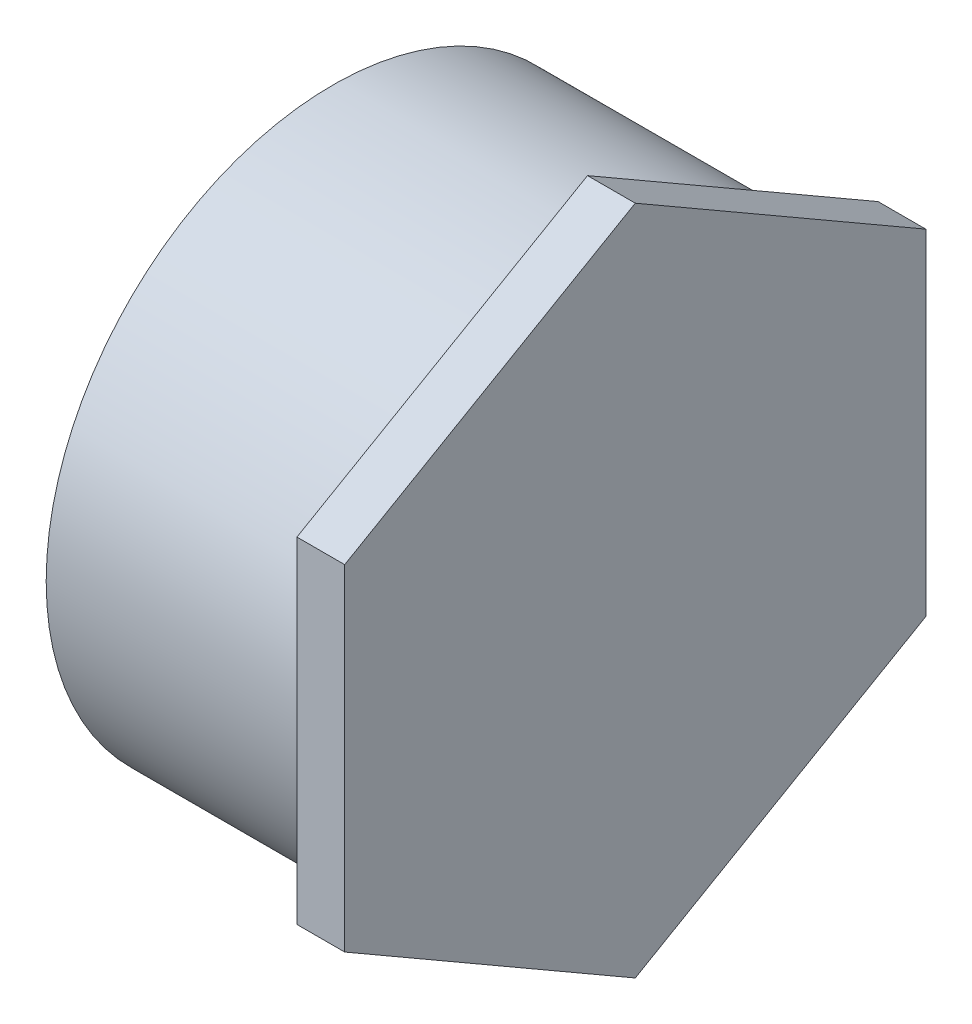
ISO-10303-21;
HEADER;
FILE_DESCRIPTION(('STEP AP214'),'2;1');
FILE_NAME('part.step','',(''),(''),'','','');
FILE_SCHEMA(('AUTOMOTIVE_DESIGN { 1 0 10303 214 1 1 1 1 }'));
ENDSEC;
DATA;
#1=APPLICATION_CONTEXT('core data for automotive mechanical design processes');
#2=APPLICATION_PROTOCOL_DEFINITION('international standard','automotive_design',2000,#1);
#3=PRODUCT_CONTEXT('',#1,'mechanical');
#4=PRODUCT('Part','Part','',(#3));
#5=PRODUCT_RELATED_PRODUCT_CATEGORY('part','',(#4));
#6=PRODUCT_DEFINITION_FORMATION('','',#4);
#7=PRODUCT_DEFINITION_CONTEXT('part definition',#1,'design');
#8=PRODUCT_DEFINITION('design','',#6,#7);
#9=PRODUCT_DEFINITION_SHAPE('','',#8);
#10=(LENGTH_UNIT() NAMED_UNIT(*) SI_UNIT(.MILLI.,.METRE.));
#11=(NAMED_UNIT(*) PLANE_ANGLE_UNIT() SI_UNIT($,.RADIAN.));
#12=(NAMED_UNIT(*) SI_UNIT($,.STERADIAN.) SOLID_ANGLE_UNIT());
#13=UNCERTAINTY_MEASURE_WITH_UNIT(LENGTH_MEASURE(1.E-05),#10,'distance_accuracy_value','');
#14=(GEOMETRIC_REPRESENTATION_CONTEXT(3) GLOBAL_UNCERTAINTY_ASSIGNED_CONTEXT((#13)) GLOBAL_UNIT_ASSIGNED_CONTEXT((#10,
#11,#12)) REPRESENTATION_CONTEXT('',''));
#15=CARTESIAN_POINT('',(0.,0.,0.));
#16=DIRECTION('',(0.,0.,1.));
#17=DIRECTION('',(1.,0.,0.));
#18=AXIS2_PLACEMENT_3D('',#15,#16,#17);
#19=CARTESIAN_POINT('',(-30.1625,0.,0.));
#20=DIRECTION('',(-1.,0.,0.));
#21=DIRECTION('',(0.,0.,1.));
#22=AXIS2_PLACEMENT_3D('',#19,#20,#21);
#23=CYLINDRICAL_SURFACE('',#22,57.15);
#24=CARTESIAN_POINT('',(-30.1625,0.,0.));
#25=DIRECTION('',(-1.,0.,0.));
#26=DIRECTION('',(0.,0.,1.));
#27=AXIS2_PLACEMENT_3D('',#24,#25,#26);
#28=CIRCLE('',#27,57.15);
#29=CARTESIAN_POINT('',(-30.1625,0.,57.15));
#30=VERTEX_POINT('',#29);
#31=EDGE_CURVE('E11',#30,#30,#28,.T.);
#32=ORIENTED_EDGE('',*,*,#31,.F.);
#33=EDGE_LOOP('',(#32));
#34=FACE_BOUND('',#33,.T.);
#35=CARTESIAN_POINT('',(20.6375,0.,0.));
#36=DIRECTION('',(1.,0.,0.));
#37=DIRECTION('',(0.,0.,-1.));
#38=AXIS2_PLACEMENT_3D('',#35,#36,#37);
#39=CIRCLE('',#38,57.15);
#40=CARTESIAN_POINT('',(20.6375,0.,-57.15));
#41=VERTEX_POINT('',#40);
#42=EDGE_CURVE('E124',#41,#41,#39,.T.);
#43=ORIENTED_EDGE('',*,*,#42,.F.);
#44=EDGE_LOOP('',(#43));
#45=FACE_BOUND('',#44,.T.);
#46=ADVANCED_FACE('F32',(#34,#45),#23,.T.);
#47=CARTESIAN_POINT('',(-30.1625,-51.1302,0.));
#48=DIRECTION('',(-1.,0.,0.));
#49=DIRECTION('',(0.,0.,1.));
#50=AXIS2_PLACEMENT_3D('',#47,#48,#49);
#51=PLANE('',#50);
#52=ORIENTED_EDGE('',*,*,#31,.T.);
#53=EDGE_LOOP('',(#52));
#54=FACE_BOUND('',#53,.T.);
#55=CARTESIAN_POINT('',(-30.1625,0.,0.));
#56=DIRECTION('',(-1.,0.,0.));
#57=DIRECTION('',(0.,0.,1.));
#58=AXIS2_PLACEMENT_3D('',#55,#56,#57);
#59=CIRCLE('',#58,51.1302);
#60=CARTESIAN_POINT('',(-30.1625,0.,51.1302));
#61=VERTEX_POINT('',#60);
#62=EDGE_CURVE('E138',#61,#61,#59,.T.);
#63=ORIENTED_EDGE('',*,*,#62,.F.);
#64=EDGE_LOOP('',(#63));
#65=FACE_BOUND('',#64,.T.);
#66=ADVANCED_FACE('F34',(#54,#65),#51,.T.);
#67=CARTESIAN_POINT('',(20.6375,0.,0.));
#68=DIRECTION('',(-1.,0.,0.));
#69=DIRECTION('',(0.,0.,1.));
#70=AXIS2_PLACEMENT_3D('',#67,#68,#69);
#71=PLANE('',#70);
#72=CARTESIAN_POINT('',(20.6375,0.,0.));
#73=DIRECTION('',(-1.,0.,0.));
#74=DIRECTION('',(0.,0.,1.));
#75=AXIS2_PLACEMENT_3D('',#72,#73,#74);
#76=CIRCLE('',#75,51.1302);
#77=CARTESIAN_POINT('',(20.6375,0.,51.1302));
#78=VERTEX_POINT('',#77);
#79=EDGE_CURVE('E41',#78,#78,#76,.T.);
#80=ORIENTED_EDGE('',*,*,#79,.T.);
#81=EDGE_LOOP('',(#80));
#82=FACE_BOUND('',#81,.T.);
#83=ADVANCED_FACE('F148',(#82),#71,.T.);
#84=CARTESIAN_POINT('',(-30.1625,0.,0.));
#85=DIRECTION('',(-1.,0.,0.));
#86=DIRECTION('',(0.,0.,1.));
#87=AXIS2_PLACEMENT_3D('',#84,#85,#86);
#88=CYLINDRICAL_SURFACE('',#87,51.1302);
#89=ORIENTED_EDGE('',*,*,#62,.T.);
#90=EDGE_LOOP('',(#89));
#91=FACE_BOUND('',#90,.T.);
#92=ORIENTED_EDGE('',*,*,#79,.F.);
#93=EDGE_LOOP('',(#92));
#94=FACE_BOUND('',#93,.T.);
#95=ADVANCED_FACE('F150',(#91,#94),#88,.F.);
#96=CARTESIAN_POINT('',(20.6375,33.4538396603564,-57.94375));
#97=DIRECTION('',(0.,0.866025403784439,-0.5));
#98=DIRECTION('',(0.,0.5,0.866025403784439));
#99=AXIS2_PLACEMENT_3D('',#96,#97,#98);
#100=PLANE('',#99);
#101=DIRECTION('',(0.,0.5,0.866025403784439));
#102=VECTOR('',#101,1.);
#103=CARTESIAN_POINT('',(30.1625,33.4538396603564,-57.94375));
#104=LINE('',#103,#102);
#105=CARTESIAN_POINT('',(30.1625,33.4538396603564,-57.94375));
#106=VERTEX_POINT('',#105);
#107=CARTESIAN_POINT('',(30.1625,66.9076793207127,0.));
#108=VERTEX_POINT('',#107);
#109=EDGE_CURVE('E120',#106,#108,#104,.T.);
#110=ORIENTED_EDGE('',*,*,#109,.F.);
#111=DIRECTION('',(1.,0.,0.));
#112=VECTOR('',#111,1.);
#113=CARTESIAN_POINT('',(20.6375,33.4538396603564,-57.94375));
#114=LINE('',#113,#112);
#115=CARTESIAN_POINT('',(20.6375,33.4538396603564,-57.94375));
#116=VERTEX_POINT('',#115);
#117=EDGE_CURVE('E49',#116,#106,#114,.T.);
#118=ORIENTED_EDGE('',*,*,#117,.F.);
#119=DIRECTION('',(0.,0.5,0.866025403784439));
#120=VECTOR('',#119,1.);
#121=CARTESIAN_POINT('',(20.6375,33.4538396603564,-57.94375));
#122=LINE('',#121,#120);
#123=CARTESIAN_POINT('',(20.6375,66.9076793207127,0.));
#124=VERTEX_POINT('',#123);
#125=EDGE_CURVE('E136',#116,#124,#122,.T.);
#126=ORIENTED_EDGE('',*,*,#125,.T.);
#127=DIRECTION('',(1.,0.,0.));
#128=VECTOR('',#127,1.);
#129=CARTESIAN_POINT('',(20.6375,66.9076793207127,0.));
#130=LINE('',#129,#128);
#131=EDGE_CURVE('E84',#124,#108,#130,.T.);
#132=ORIENTED_EDGE('',*,*,#131,.T.);
#133=EDGE_LOOP('',(#110,#118,#126,#132));
#134=FACE_BOUND('',#133,.T.);
#135=ADVANCED_FACE('F152',(#134),#100,.T.);
#136=CARTESIAN_POINT('',(20.6375,-33.4538396603564,-57.9437499999999));
#137=DIRECTION('',(0.,0.,-1.));
#138=DIRECTION('',(0.,1.,0.));
#139=AXIS2_PLACEMENT_3D('',#136,#137,#138);
#140=PLANE('',#139);
#141=DIRECTION('',(0.,1.,0.));
#142=VECTOR('',#141,1.);
#143=CARTESIAN_POINT('',(30.1625,-33.4538396603564,-57.9437499999999));
#144=LINE('',#143,#142);
#145=CARTESIAN_POINT('',(30.1625,-33.4538396603564,-57.9437499999999));
#146=VERTEX_POINT('',#145);
#147=EDGE_CURVE('E133',#146,#106,#144,.T.);
#148=ORIENTED_EDGE('',*,*,#147,.F.);
#149=DIRECTION('',(1.,0.,0.));
#150=VECTOR('',#149,1.);
#151=CARTESIAN_POINT('',(20.6375,-33.4538396603564,-57.9437499999999));
#152=LINE('',#151,#150);
#153=CARTESIAN_POINT('',(20.6375,-33.4538396603564,-57.9437499999999));
#154=VERTEX_POINT('',#153);
#155=EDGE_CURVE('E72',#154,#146,#152,.T.);
#156=ORIENTED_EDGE('',*,*,#155,.F.);
#157=DIRECTION('',(0.,1.,0.));
#158=VECTOR('',#157,1.);
#159=CARTESIAN_POINT('',(20.6375,-33.4538396603564,-57.9437499999999));
#160=LINE('',#159,#158);
#161=EDGE_CURVE('E110',#154,#116,#160,.T.);
#162=ORIENTED_EDGE('',*,*,#161,.T.);
#163=ORIENTED_EDGE('',*,*,#117,.T.);
#164=EDGE_LOOP('',(#148,#156,#162,#163));
#165=FACE_BOUND('',#164,.T.);
#166=ADVANCED_FACE('F159',(#165),#140,.T.);
#167=CARTESIAN_POINT('',(20.6375,-66.9076793207128,0.));
#168=DIRECTION('',(0.,-0.866025403784439,-0.5));
#169=DIRECTION('',(0.,0.5,-0.866025403784439));
#170=AXIS2_PLACEMENT_3D('',#167,#168,#169);
#171=PLANE('',#170);
#172=DIRECTION('',(0.,0.5,-0.866025403784439));
#173=VECTOR('',#172,1.);
#174=CARTESIAN_POINT('',(30.1625,-66.9076793207128,0.));
#175=LINE('',#174,#173);
#176=CARTESIAN_POINT('',(30.1625,-66.9076793207128,0.));
#177=VERTEX_POINT('',#176);
#178=EDGE_CURVE('E97',#177,#146,#175,.T.);
#179=ORIENTED_EDGE('',*,*,#178,.F.);
#180=DIRECTION('',(1.,0.,0.));
#181=VECTOR('',#180,1.);
#182=CARTESIAN_POINT('',(20.6375,-66.9076793207128,0.));
#183=LINE('',#182,#181);
#184=CARTESIAN_POINT('',(20.6375,-66.9076793207128,0.));
#185=VERTEX_POINT('',#184);
#186=EDGE_CURVE('E92',#185,#177,#183,.T.);
#187=ORIENTED_EDGE('',*,*,#186,.F.);
#188=DIRECTION('',(0.,0.5,-0.866025403784439));
#189=VECTOR('',#188,1.);
#190=CARTESIAN_POINT('',(20.6375,-66.9076793207128,0.));
#191=LINE('',#190,#189);
#192=EDGE_CURVE('E95',#185,#154,#191,.T.);
#193=ORIENTED_EDGE('',*,*,#192,.T.);
#194=ORIENTED_EDGE('',*,*,#155,.T.);
#195=EDGE_LOOP('',(#179,#187,#193,#194));
#196=FACE_BOUND('',#195,.T.);
#197=ADVANCED_FACE('F94',(#196),#171,.T.);
#198=CARTESIAN_POINT('',(20.6375,-33.4538396603564,57.94375));
#199=DIRECTION('',(0.,-0.866025403784439,0.5));
#200=DIRECTION('',(0.,-0.5,-0.866025403784439));
#201=AXIS2_PLACEMENT_3D('',#198,#199,#200);
#202=PLANE('',#201);
#203=DIRECTION('',(0.,-0.5,-0.866025403784438));
#204=VECTOR('',#203,1.);
#205=CARTESIAN_POINT('',(30.1625,-33.4538396603564,57.94375));
#206=LINE('',#205,#204);
#207=CARTESIAN_POINT('',(30.1625,-33.4538396603564,57.94375));
#208=VERTEX_POINT('',#207);
#209=EDGE_CURVE('E130',#208,#177,#206,.T.);
#210=ORIENTED_EDGE('',*,*,#209,.F.);
#211=DIRECTION('',(1.,0.,0.));
#212=VECTOR('',#211,1.);
#213=CARTESIAN_POINT('',(20.6375,-33.4538396603564,57.94375));
#214=LINE('',#213,#212);
#215=CARTESIAN_POINT('',(20.6375,-33.4538396603564,57.94375));
#216=VERTEX_POINT('',#215);
#217=EDGE_CURVE('E102',#216,#208,#214,.T.);
#218=ORIENTED_EDGE('',*,*,#217,.F.);
#219=DIRECTION('',(0.,-0.5,-0.866025403784438));
#220=VECTOR('',#219,1.);
#221=CARTESIAN_POINT('',(20.6375,-33.4538396603564,57.94375));
#222=LINE('',#221,#220);
#223=EDGE_CURVE('E108',#216,#185,#222,.T.);
#224=ORIENTED_EDGE('',*,*,#223,.T.);
#225=ORIENTED_EDGE('',*,*,#186,.T.);
#226=EDGE_LOOP('',(#210,#218,#224,#225));
#227=FACE_BOUND('',#226,.T.);
#228=ADVANCED_FACE('F112',(#227),#202,.T.);
#229=CARTESIAN_POINT('',(20.6375,33.4538396603564,57.94375));
#230=DIRECTION('',(0.,0.,1.));
#231=DIRECTION('',(1.,0.,0.));
#232=AXIS2_PLACEMENT_3D('',#229,#230,#231);
#233=PLANE('',#232);
#234=DIRECTION('',(0.,-1.,0.));
#235=VECTOR('',#234,1.);
#236=CARTESIAN_POINT('',(30.1625,33.4538396603564,57.94375));
#237=LINE('',#236,#235);
#238=CARTESIAN_POINT('',(30.1625,33.4538396603564,57.94375));
#239=VERTEX_POINT('',#238);
#240=EDGE_CURVE('E127',#239,#208,#237,.T.);
#241=ORIENTED_EDGE('',*,*,#240,.F.);
#242=DIRECTION('',(1.,0.,0.));
#243=VECTOR('',#242,1.);
#244=CARTESIAN_POINT('',(20.6375,33.4538396603564,57.94375));
#245=LINE('',#244,#243);
#246=CARTESIAN_POINT('',(20.6375,33.4538396603564,57.94375));
#247=VERTEX_POINT('',#246);
#248=EDGE_CURVE('E141',#247,#239,#245,.T.);
#249=ORIENTED_EDGE('',*,*,#248,.F.);
#250=DIRECTION('',(0.,-1.,0.));
#251=VECTOR('',#250,1.);
#252=CARTESIAN_POINT('',(20.6375,33.4538396603564,57.94375));
#253=LINE('',#252,#251);
#254=EDGE_CURVE('E113',#247,#216,#253,.T.);
#255=ORIENTED_EDGE('',*,*,#254,.T.);
#256=ORIENTED_EDGE('',*,*,#217,.T.);
#257=EDGE_LOOP('',(#241,#249,#255,#256));
#258=FACE_BOUND('',#257,.T.);
#259=ADVANCED_FACE('F182',(#258),#233,.T.);
#260=CARTESIAN_POINT('',(20.6375,66.9076793207127,0.));
#261=DIRECTION('',(0.,0.866025403784439,0.5));
#262=DIRECTION('',(0.,-0.5,0.866025403784439));
#263=AXIS2_PLACEMENT_3D('',#260,#261,#262);
#264=PLANE('',#263);
#265=DIRECTION('',(0.,-0.5,0.866025403784439));
#266=VECTOR('',#265,1.);
#267=CARTESIAN_POINT('',(30.1625,66.9076793207127,0.));
#268=LINE('',#267,#266);
#269=EDGE_CURVE('E123',#108,#239,#268,.T.);
#270=ORIENTED_EDGE('',*,*,#269,.F.);
#271=ORIENTED_EDGE('',*,*,#131,.F.);
#272=DIRECTION('',(0.,-0.5,0.866025403784439));
#273=VECTOR('',#272,1.);
#274=CARTESIAN_POINT('',(20.6375,66.9076793207127,0.));
#275=LINE('',#274,#273);
#276=EDGE_CURVE('E115',#124,#247,#275,.T.);
#277=ORIENTED_EDGE('',*,*,#276,.T.);
#278=ORIENTED_EDGE('',*,*,#248,.T.);
#279=EDGE_LOOP('',(#270,#271,#277,#278));
#280=FACE_BOUND('',#279,.T.);
#281=ADVANCED_FACE('F177',(#280),#264,.T.);
#282=CARTESIAN_POINT('',(20.6375,66.9076793207127,0.));
#283=DIRECTION('',(1.,0.,0.));
#284=DIRECTION('',(0.,0.,-1.));
#285=AXIS2_PLACEMENT_3D('',#282,#283,#284);
#286=PLANE('',#285);
#287=ORIENTED_EDGE('',*,*,#42,.T.);
#288=EDGE_LOOP('',(#287));
#289=FACE_BOUND('',#288,.T.);
#290=ORIENTED_EDGE('',*,*,#125,.F.);
#291=ORIENTED_EDGE('',*,*,#161,.F.);
#292=ORIENTED_EDGE('',*,*,#192,.F.);
#293=ORIENTED_EDGE('',*,*,#223,.F.);
#294=ORIENTED_EDGE('',*,*,#254,.F.);
#295=ORIENTED_EDGE('',*,*,#276,.F.);
#296=EDGE_LOOP('',(#290,#291,#292,#293,#294,#295));
#297=FACE_BOUND('',#296,.T.);
#298=ADVANCED_FACE('F106',(#289,#297),#286,.F.);
#299=CARTESIAN_POINT('',(30.1625,0.,0.));
#300=DIRECTION('',(1.,0.,0.));
#301=DIRECTION('',(0.,0.,-1.));
#302=AXIS2_PLACEMENT_3D('',#299,#300,#301);
#303=PLANE('',#302);
#304=ORIENTED_EDGE('',*,*,#109,.T.);
#305=ORIENTED_EDGE('',*,*,#269,.T.);
#306=ORIENTED_EDGE('',*,*,#240,.T.);
#307=ORIENTED_EDGE('',*,*,#209,.T.);
#308=ORIENTED_EDGE('',*,*,#178,.T.);
#309=ORIENTED_EDGE('',*,*,#147,.T.);
#310=EDGE_LOOP('',(#304,#305,#306,#307,#308,#309));
#311=FACE_BOUND('',#310,.T.);
#312=ADVANCED_FACE('F171',(#311),#303,.T.);
#313=CLOSED_SHELL('',(#46,#66,#83,#95,#135,#166,#197,#228,#259,#281,#298,#312));
#314=MANIFOLD_SOLID_BREP('B2',#313);
#315=ADVANCED_BREP_SHAPE_REPRESENTATION('',(#18,#314),#14);
#316=SHAPE_DEFINITION_REPRESENTATION(#9,#315);
ENDSEC;
END-ISO-10303-21;
